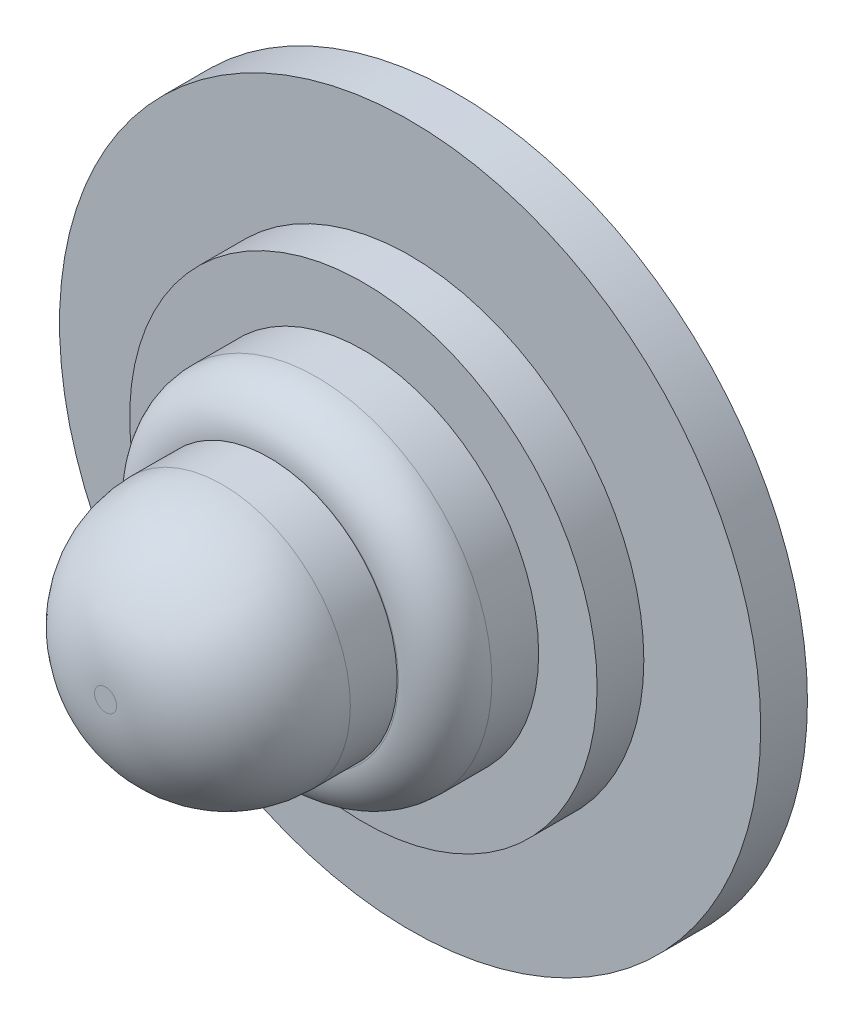
ISO-10303-21;
HEADER;
FILE_DESCRIPTION(('STEP AP214'),'2;1');
FILE_NAME('part.step','',(''),(''),'','','');
FILE_SCHEMA(('AUTOMOTIVE_DESIGN { 1 0 10303 214 1 1 1 1 }'));
ENDSEC;
DATA;
#1=APPLICATION_CONTEXT('core data for automotive mechanical design processes');
#2=APPLICATION_PROTOCOL_DEFINITION('international standard','automotive_design',2000,#1);
#3=PRODUCT_CONTEXT('',#1,'mechanical');
#4=PRODUCT('Part','Part','',(#3));
#5=PRODUCT_RELATED_PRODUCT_CATEGORY('part','',(#4));
#6=PRODUCT_DEFINITION_FORMATION('','',#4);
#7=PRODUCT_DEFINITION_CONTEXT('part definition',#1,'design');
#8=PRODUCT_DEFINITION('design','',#6,#7);
#9=PRODUCT_DEFINITION_SHAPE('','',#8);
#10=(LENGTH_UNIT() NAMED_UNIT(*) SI_UNIT(.MILLI.,.METRE.));
#11=(NAMED_UNIT(*) PLANE_ANGLE_UNIT() SI_UNIT($,.RADIAN.));
#12=(NAMED_UNIT(*) SI_UNIT($,.STERADIAN.) SOLID_ANGLE_UNIT());
#13=UNCERTAINTY_MEASURE_WITH_UNIT(LENGTH_MEASURE(1.E-05),#10,'distance_accuracy_value','');
#14=(GEOMETRIC_REPRESENTATION_CONTEXT(3) GLOBAL_UNCERTAINTY_ASSIGNED_CONTEXT((#13)) GLOBAL_UNIT_ASSIGNED_CONTEXT((#10,
#11,#12)) REPRESENTATION_CONTEXT('',''));
#15=CARTESIAN_POINT('',(0.,0.,0.));
#16=DIRECTION('',(0.,0.,1.));
#17=DIRECTION('',(1.,0.,0.));
#18=AXIS2_PLACEMENT_3D('',#15,#16,#17);
#19=CARTESIAN_POINT('',(-7.53273260334649,13.1274320611718,2.));
#20=DIRECTION('',(0.,0.,-1.));
#21=DIRECTION('',(-1.,0.,0.));
#22=AXIS2_PLACEMENT_3D('',#19,#20,#21);
#23=CYLINDRICAL_SURFACE('',#22,15.);
#24=CARTESIAN_POINT('',(-7.53273260334649,13.1274320611718,2.));
#25=DIRECTION('',(0.,0.,1.));
#26=DIRECTION('',(1.,0.,0.));
#27=AXIS2_PLACEMENT_3D('',#24,#25,#26);
#28=CIRCLE('',#27,15.);
#29=CARTESIAN_POINT('',(7.46726739665351,13.1274320611718,2.));
#30=VERTEX_POINT('',#29);
#31=EDGE_CURVE('E83',#30,#30,#28,.T.);
#32=ORIENTED_EDGE('',*,*,#31,.F.);
#33=EDGE_LOOP('',(#32));
#34=FACE_BOUND('',#33,.T.);
#35=CARTESIAN_POINT('',(-7.53273260334649,13.1274320611718,0.));
#36=DIRECTION('',(0.,0.,1.));
#37=DIRECTION('',(1.,0.,0.));
#38=AXIS2_PLACEMENT_3D('',#35,#36,#37);
#39=CIRCLE('',#38,15.);
#40=CARTESIAN_POINT('',(7.46726739665351,13.1274320611718,0.));
#41=VERTEX_POINT('',#40);
#42=EDGE_CURVE('E75',#41,#41,#39,.T.);
#43=ORIENTED_EDGE('',*,*,#42,.T.);
#44=EDGE_LOOP('',(#43));
#45=FACE_BOUND('',#44,.T.);
#46=ADVANCED_FACE('F39',(#34,#45),#23,.T.);
#47=CARTESIAN_POINT('',(-7.53273260334649,13.1274320611718,2.));
#48=DIRECTION('',(0.,0.,1.));
#49=DIRECTION('',(1.,0.,0.));
#50=AXIS2_PLACEMENT_3D('',#47,#48,#49);
#51=PLANE('',#50);
#52=CARTESIAN_POINT('',(-7.53273260334649,13.1274320611718,2.));
#53=DIRECTION('',(0.,0.,1.));
#54=DIRECTION('',(1.,0.,0.));
#55=AXIS2_PLACEMENT_3D('',#52,#53,#54);
#56=CIRCLE('',#55,10.);
#57=CARTESIAN_POINT('',(2.46726739665351,13.1274320611718,2.));
#58=VERTEX_POINT('',#57);
#59=EDGE_CURVE('E79',#58,#58,#56,.T.);
#60=ORIENTED_EDGE('',*,*,#59,.F.);
#61=EDGE_LOOP('',(#60));
#62=FACE_BOUND('',#61,.T.);
#63=ORIENTED_EDGE('',*,*,#31,.T.);
#64=EDGE_LOOP('',(#63));
#65=FACE_BOUND('',#64,.T.);
#66=ADVANCED_FACE('F102',(#62,#65),#51,.T.);
#67=CARTESIAN_POINT('',(-7.53273260334649,13.1274320611718,0.));
#68=DIRECTION('',(0.,0.,1.));
#69=DIRECTION('',(1.,0.,0.));
#70=AXIS2_PLACEMENT_3D('',#67,#68,#69);
#71=PLANE('',#70);
#72=ORIENTED_EDGE('',*,*,#42,.F.);
#73=EDGE_LOOP('',(#72));
#74=FACE_BOUND('',#73,.T.);
#75=ADVANCED_FACE('F108',(#74),#71,.F.);
#76=CARTESIAN_POINT('',(-7.53273260334649,13.1274320611718,4.));
#77=DIRECTION('',(0.,0.,-1.));
#78=DIRECTION('',(-1.,0.,0.));
#79=AXIS2_PLACEMENT_3D('',#76,#77,#78);
#80=CYLINDRICAL_SURFACE('',#79,10.);
#81=CARTESIAN_POINT('',(-7.53273260334649,13.1274320611718,4.));
#82=DIRECTION('',(0.,0.,1.));
#83=DIRECTION('',(1.,0.,0.));
#84=AXIS2_PLACEMENT_3D('',#81,#82,#83);
#85=CIRCLE('',#84,10.);
#86=CARTESIAN_POINT('',(2.46726739665351,13.1274320611718,4.));
#87=VERTEX_POINT('',#86);
#88=EDGE_CURVE('E73',#87,#87,#85,.T.);
#89=ORIENTED_EDGE('',*,*,#88,.F.);
#90=EDGE_LOOP('',(#89));
#91=FACE_BOUND('',#90,.T.);
#92=ORIENTED_EDGE('',*,*,#59,.T.);
#93=EDGE_LOOP('',(#92));
#94=FACE_BOUND('',#93,.T.);
#95=ADVANCED_FACE('F134',(#91,#94),#80,.T.);
#96=CARTESIAN_POINT('',(-7.53273260334649,13.1274320611718,4.));
#97=DIRECTION('',(0.,0.,1.));
#98=DIRECTION('',(1.,0.,0.));
#99=AXIS2_PLACEMENT_3D('',#96,#97,#98);
#100=PLANE('',#99);
#101=CARTESIAN_POINT('',(-7.53273260334649,13.1274320611718,4.));
#102=DIRECTION('',(0.,0.,1.));
#103=DIRECTION('',(1.,0.,0.));
#104=AXIS2_PLACEMENT_3D('',#101,#102,#103);
#105=CIRCLE('',#104,7.5);
#106=CARTESIAN_POINT('',(-0.0327326033464879,13.1274320611718,4.));
#107=VERTEX_POINT('',#106);
#108=EDGE_CURVE('E60',#107,#107,#105,.T.);
#109=ORIENTED_EDGE('',*,*,#108,.F.);
#110=EDGE_LOOP('',(#109));
#111=FACE_BOUND('',#110,.T.);
#112=ORIENTED_EDGE('',*,*,#88,.T.);
#113=EDGE_LOOP('',(#112));
#114=FACE_BOUND('',#113,.T.);
#115=ADVANCED_FACE('F128',(#111,#114),#100,.T.);
#116=CARTESIAN_POINT('',(-7.53273260334649,13.1274320611718,8.));
#117=DIRECTION('',(0.,0.,-1.));
#118=DIRECTION('',(-1.,0.,0.));
#119=AXIS2_PLACEMENT_3D('',#116,#117,#118);
#120=CYLINDRICAL_SURFACE('',#119,7.5);
#121=CARTESIAN_POINT('',(-7.53273260334649,13.1274320611718,6.));
#122=DIRECTION('',(0.,0.,1.));
#123=DIRECTION('',(1.,0.,0.));
#124=AXIS2_PLACEMENT_3D('',#121,#122,#123);
#125=CIRCLE('',#124,7.5);
#126=CARTESIAN_POINT('',(-0.0327326033464879,13.1274320611718,6.));
#127=VERTEX_POINT('',#126);
#128=EDGE_CURVE('E71',#127,#127,#125,.F.);
#129=ORIENTED_EDGE('',*,*,#128,.T.);
#130=EDGE_LOOP('',(#129));
#131=FACE_BOUND('',#130,.T.);
#132=ORIENTED_EDGE('',*,*,#108,.T.);
#133=EDGE_LOOP('',(#132));
#134=FACE_BOUND('',#133,.T.);
#135=ADVANCED_FACE('F122',(#131,#134),#120,.T.);
#136=CARTESIAN_POINT('',(-7.53273260334649,13.1274320611718,8.));
#137=DIRECTION('',(0.,0.,1.));
#138=DIRECTION('',(1.,0.,0.));
#139=AXIS2_PLACEMENT_3D('',#136,#137,#138);
#140=PLANE('',#139);
#141=CARTESIAN_POINT('',(-7.53273260334649,13.1274320611718,8.));
#142=DIRECTION('',(0.,0.,1.));
#143=DIRECTION('',(1.,0.,0.));
#144=AXIS2_PLACEMENT_3D('',#141,#142,#143);
#145=CIRCLE('',#144,5.5);
#146=CARTESIAN_POINT('',(-13.0321454550706,13.0470685975119,8.));
#147=VERTEX_POINT('',#146);
#148=CARTESIAN_POINT('',(-7.92184057104694,18.6136507033216,8.));
#149=VERTEX_POINT('',#148);
#150=EDGE_CURVE('E53',#147,#149,#145,.T.);
#151=ORIENTED_EDGE('',*,*,#150,.T.);
#152=CARTESIAN_POINT('',(-7.56166022799555,13.1539885690463,8.));
#153=DIRECTION('',(0.,0.,1.));
#154=DIRECTION('',(1.,0.,0.));
#155=AXIS2_PLACEMENT_3D('',#152,#153,#154);
#156=CIRCLE('',#155,5.47152999625878);
#157=EDGE_CURVE('E62',#147,#149,#156,.T.);
#158=ORIENTED_EDGE('',*,*,#157,.F.);
#159=EDGE_LOOP('',(#151,#158));
#160=FACE_BOUND('',#159,.T.);
#161=ADVANCED_FACE('F63',(#160),#140,.T.);
#162=CARTESIAN_POINT('',(-7.53273260334649,13.1274320611718,6.));
#163=DIRECTION('',(0.,0.,1.));
#164=DIRECTION('',(1.,0.,0.));
#165=AXIS2_PLACEMENT_3D('',#162,#163,#164);
#166=TOROIDAL_SURFACE('',#165,5.5,2.);
#167=ORIENTED_EDGE('',*,*,#128,.F.);
#168=EDGE_LOOP('',(#167));
#169=FACE_BOUND('',#168,.T.);
#170=EDGE_CURVE('E58',#149,#147,#145,.T.);
#171=ORIENTED_EDGE('',*,*,#170,.F.);
#172=ORIENTED_EDGE('',*,*,#150,.F.);
#173=EDGE_LOOP('',(#171,#172));
#174=FACE_BOUND('',#173,.T.);
#175=ADVANCED_FACE('F56',(#169,#174),#166,.T.);
#176=CARTESIAN_POINT('',(-7.56166022799555,13.1539885690463,15.));
#177=DIRECTION('',(0.,0.,-1.));
#178=DIRECTION('',(-1.,0.,0.));
#179=AXIS2_PLACEMENT_3D('',#176,#177,#178);
#180=CYLINDRICAL_SURFACE('',#179,5.47152999625878);
#181=CARTESIAN_POINT('',(-7.56166022799555,13.1539885690463,10.));
#182=DIRECTION('',(0.,0.,1.));
#183=DIRECTION('',(1.,0.,0.));
#184=AXIS2_PLACEMENT_3D('',#181,#182,#183);
#185=CIRCLE('',#184,5.47152999625878);
#186=CARTESIAN_POINT('',(-2.09013023173677,13.1539885690463,10.));
#187=VERTEX_POINT('',#186);
#188=EDGE_CURVE('E11',#187,#187,#185,.F.);
#189=ORIENTED_EDGE('',*,*,#188,.T.);
#190=EDGE_LOOP('',(#189));
#191=FACE_BOUND('',#190,.T.);
#192=EDGE_CURVE('E67',#149,#147,#156,.T.);
#193=ORIENTED_EDGE('',*,*,#192,.T.);
#194=ORIENTED_EDGE('',*,*,#157,.T.);
#195=EDGE_LOOP('',(#193,#194));
#196=FACE_BOUND('',#195,.T.);
#197=ADVANCED_FACE('F72',(#191,#196),#180,.T.);
#198=CARTESIAN_POINT('',(-7.56166022799555,13.1539885690463,15.));
#199=DIRECTION('',(0.,0.,1.));
#200=DIRECTION('',(1.,0.,0.));
#201=AXIS2_PLACEMENT_3D('',#198,#199,#200);
#202=PLANE('',#201);
#203=CARTESIAN_POINT('',(-7.56166022799555,13.1539885690463,15.));
#204=DIRECTION('',(0.,0.,1.));
#205=DIRECTION('',(1.,0.,0.));
#206=AXIS2_PLACEMENT_3D('',#203,#204,#205);
#207=CIRCLE('',#206,0.471529996258776);
#208=CARTESIAN_POINT('',(-7.09013023173677,13.1539885690463,15.));
#209=VERTEX_POINT('',#208);
#210=EDGE_CURVE('E47',#209,#209,#207,.T.);
#211=ORIENTED_EDGE('',*,*,#210,.T.);
#212=EDGE_LOOP('',(#211));
#213=FACE_BOUND('',#212,.T.);
#214=ADVANCED_FACE('F92',(#213),#202,.T.);
#215=CARTESIAN_POINT('',(-7.56166022799555,13.1539885690463,8.));
#216=DIRECTION('',(0.,0.,1.));
#217=DIRECTION('',(1.,0.,0.));
#218=AXIS2_PLACEMENT_3D('',#215,#216,#217);
#219=PLANE('',#218);
#220=ORIENTED_EDGE('',*,*,#170,.T.);
#221=ORIENTED_EDGE('',*,*,#192,.F.);
#222=EDGE_LOOP('',(#220,#221));
#223=FACE_BOUND('',#222,.T.);
#224=ADVANCED_FACE('F70',(#223),#219,.F.);
#225=CARTESIAN_POINT('',(-7.56166022799555,13.1539885690463,10.));
#226=DIRECTION('',(0.,0.,1.));
#227=DIRECTION('',(1.,0.,0.));
#228=AXIS2_PLACEMENT_3D('',#225,#226,#227);
#229=DEGENERATE_TOROIDAL_SURFACE('',#228,0.471529996258776,5.,.T.);
#230=ORIENTED_EDGE('',*,*,#188,.F.);
#231=EDGE_LOOP('',(#230));
#232=FACE_BOUND('',#231,.T.);
#233=ORIENTED_EDGE('',*,*,#210,.F.);
#234=EDGE_LOOP('',(#233));
#235=FACE_BOUND('',#234,.T.);
#236=ADVANCED_FACE('F41',(#232,#235),#229,.T.);
#237=CLOSED_SHELL('',(#46,#66,#75,#95,#115,#135,#161,#175,#197,#214,#224,#236));
#238=MANIFOLD_SOLID_BREP('B2',#237);
#239=ADVANCED_BREP_SHAPE_REPRESENTATION('',(#18,#238),#14);
#240=SHAPE_DEFINITION_REPRESENTATION(#9,#239);
ENDSEC;
END-ISO-10303-21;
